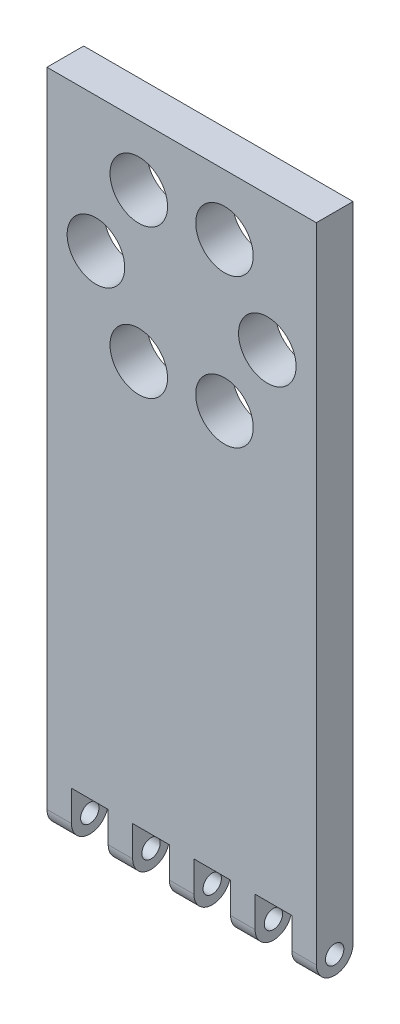
ISO-10303-21;
HEADER;
FILE_DESCRIPTION(('STEP AP214'),'2;1');
FILE_NAME('part.step','',(''),(''),'','','');
FILE_SCHEMA(('AUTOMOTIVE_DESIGN { 1 0 10303 214 1 1 1 1 }'));
ENDSEC;
DATA;
#1=APPLICATION_CONTEXT('core data for automotive mechanical design processes');
#2=APPLICATION_PROTOCOL_DEFINITION('international standard','automotive_design',2000,#1);
#3=PRODUCT_CONTEXT('',#1,'mechanical');
#4=PRODUCT('Part','Part','',(#3));
#5=PRODUCT_RELATED_PRODUCT_CATEGORY('part','',(#4));
#6=PRODUCT_DEFINITION_FORMATION('','',#4);
#7=PRODUCT_DEFINITION_CONTEXT('part definition',#1,'design');
#8=PRODUCT_DEFINITION('design','',#6,#7);
#9=PRODUCT_DEFINITION_SHAPE('','',#8);
#10=(LENGTH_UNIT() NAMED_UNIT(*) SI_UNIT(.MILLI.,.METRE.));
#11=(NAMED_UNIT(*) PLANE_ANGLE_UNIT() SI_UNIT($,.RADIAN.));
#12=(NAMED_UNIT(*) SI_UNIT($,.STERADIAN.) SOLID_ANGLE_UNIT());
#13=UNCERTAINTY_MEASURE_WITH_UNIT(LENGTH_MEASURE(1.E-05),#10,'distance_accuracy_value','');
#14=(GEOMETRIC_REPRESENTATION_CONTEXT(3) GLOBAL_UNCERTAINTY_ASSIGNED_CONTEXT((#13)) GLOBAL_UNIT_ASSIGNED_CONTEXT((#10,
#11,#12)) REPRESENTATION_CONTEXT('',''));
#15=CARTESIAN_POINT('',(0.,0.,0.));
#16=DIRECTION('',(0.,0.,1.));
#17=DIRECTION('',(1.,0.,0.));
#18=AXIS2_PLACEMENT_3D('',#15,#16,#17);
#19=CARTESIAN_POINT('',(-22.,-50.,6.));
#20=DIRECTION('',(0.,1.,0.));
#21=DIRECTION('',(0.,0.,1.));
#22=AXIS2_PLACEMENT_3D('',#19,#20,#21);
#23=PLANE('',#22);
#24=DIRECTION('',(0.,0.,-1.));
#25=VECTOR('',#24,1.);
#26=CARTESIAN_POINT('',(18.,-50.,6.));
#27=LINE('',#26,#25);
#28=CARTESIAN_POINT('',(18.,-50.,6.));
#29=VERTEX_POINT('',#28);
#30=CARTESIAN_POINT('',(18.,-50.,0.));
#31=VERTEX_POINT('',#30);
#32=EDGE_CURVE('E368',#29,#31,#27,.T.);
#33=ORIENTED_EDGE('',*,*,#32,.F.);
#34=DIRECTION('',(1.,0.,0.));
#35=VECTOR('',#34,1.);
#36=CARTESIAN_POINT('',(-22.,-50.,6.));
#37=LINE('',#36,#35);
#38=CARTESIAN_POINT('',(12.,-50.,6.));
#39=VERTEX_POINT('',#38);
#40=EDGE_CURVE('E228',#39,#29,#37,.T.);
#41=ORIENTED_EDGE('',*,*,#40,.F.);
#42=DIRECTION('',(0.,0.,1.));
#43=VECTOR('',#42,1.);
#44=CARTESIAN_POINT('',(12.,-50.,6.));
#45=LINE('',#44,#43);
#46=CARTESIAN_POINT('',(12.,-50.,0.));
#47=VERTEX_POINT('',#46);
#48=EDGE_CURVE('E206',#47,#39,#45,.T.);
#49=ORIENTED_EDGE('',*,*,#48,.F.);
#50=DIRECTION('',(1.,0.,0.));
#51=VECTOR('',#50,1.);
#52=CARTESIAN_POINT('',(-22.,-50.,0.));
#53=LINE('',#52,#51);
#54=EDGE_CURVE('E215',#47,#31,#53,.T.);
#55=ORIENTED_EDGE('',*,*,#54,.T.);
#56=EDGE_LOOP('',(#33,#41,#49,#55));
#57=FACE_BOUND('',#56,.T.);
#58=ADVANCED_FACE('F36',(#57),#23,.F.);
#59=DIRECTION('',(0.,0.,-1.));
#60=VECTOR('',#59,1.);
#61=CARTESIAN_POINT('',(8.00000000000001,-50.,6.));
#62=LINE('',#61,#60);
#63=CARTESIAN_POINT('',(8.00000000000001,-50.,6.));
#64=VERTEX_POINT('',#63);
#65=CARTESIAN_POINT('',(8.00000000000001,-50.,0.));
#66=VERTEX_POINT('',#65);
#67=EDGE_CURVE('E230',#64,#66,#62,.T.);
#68=ORIENTED_EDGE('',*,*,#67,.F.);
#69=CARTESIAN_POINT('',(2.00000000000001,-50.,6.));
#70=VERTEX_POINT('',#69);
#71=EDGE_CURVE('E431',#70,#64,#37,.T.);
#72=ORIENTED_EDGE('',*,*,#71,.F.);
#73=DIRECTION('',(0.,0.,1.));
#74=VECTOR('',#73,1.);
#75=CARTESIAN_POINT('',(2.00000000000001,-50.,6.));
#76=LINE('',#75,#74);
#77=CARTESIAN_POINT('',(2.00000000000001,-50.,0.));
#78=VERTEX_POINT('',#77);
#79=EDGE_CURVE('E242',#78,#70,#76,.T.);
#80=ORIENTED_EDGE('',*,*,#79,.F.);
#81=EDGE_CURVE('E222',#78,#66,#53,.T.);
#82=ORIENTED_EDGE('',*,*,#81,.T.);
#83=EDGE_LOOP('',(#68,#72,#80,#82));
#84=FACE_BOUND('',#83,.T.);
#85=ADVANCED_FACE('F457',(#84),#23,.F.);
#86=DIRECTION('',(0.,0.,-1.));
#87=VECTOR('',#86,1.);
#88=CARTESIAN_POINT('',(-1.99999999999999,-50.,6.));
#89=LINE('',#88,#87);
#90=CARTESIAN_POINT('',(-1.99999999999999,-50.,6.));
#91=VERTEX_POINT('',#90);
#92=CARTESIAN_POINT('',(-1.99999999999999,-50.,0.));
#93=VERTEX_POINT('',#92);
#94=EDGE_CURVE('E239',#91,#93,#89,.T.);
#95=ORIENTED_EDGE('',*,*,#94,.F.);
#96=CARTESIAN_POINT('',(-7.99999999999999,-50.,6.));
#97=VERTEX_POINT('',#96);
#98=EDGE_CURVE('E305',#97,#91,#37,.T.);
#99=ORIENTED_EDGE('',*,*,#98,.F.);
#100=DIRECTION('',(0.,0.,1.));
#101=VECTOR('',#100,1.);
#102=CARTESIAN_POINT('',(-7.99999999999999,-50.,6.));
#103=LINE('',#102,#101);
#104=CARTESIAN_POINT('',(-7.99999999999999,-50.,0.));
#105=VERTEX_POINT('',#104);
#106=EDGE_CURVE('E256',#105,#97,#103,.T.);
#107=ORIENTED_EDGE('',*,*,#106,.F.);
#108=EDGE_CURVE('E314',#105,#93,#53,.T.);
#109=ORIENTED_EDGE('',*,*,#108,.T.);
#110=EDGE_LOOP('',(#95,#99,#107,#109));
#111=FACE_BOUND('',#110,.T.);
#112=ADVANCED_FACE('F443',(#111),#23,.F.);
#113=DIRECTION('',(0.,0.,-1.));
#114=VECTOR('',#113,1.);
#115=CARTESIAN_POINT('',(-12.,-50.,6.));
#116=LINE('',#115,#114);
#117=CARTESIAN_POINT('',(-12.,-50.,6.));
#118=VERTEX_POINT('',#117);
#119=CARTESIAN_POINT('',(-12.,-50.,0.));
#120=VERTEX_POINT('',#119);
#121=EDGE_CURVE('E253',#118,#120,#116,.T.);
#122=ORIENTED_EDGE('',*,*,#121,.F.);
#123=CARTESIAN_POINT('',(-18.,-50.,6.));
#124=VERTEX_POINT('',#123);
#125=EDGE_CURVE('E301',#124,#118,#37,.T.);
#126=ORIENTED_EDGE('',*,*,#125,.F.);
#127=DIRECTION('',(0.,0.,1.));
#128=VECTOR('',#127,1.);
#129=CARTESIAN_POINT('',(-18.,-50.,6.));
#130=LINE('',#129,#128);
#131=CARTESIAN_POINT('',(-18.,-50.,0.));
#132=VERTEX_POINT('',#131);
#133=EDGE_CURVE('E268',#132,#124,#130,.T.);
#134=ORIENTED_EDGE('',*,*,#133,.F.);
#135=EDGE_CURVE('E225',#132,#120,#53,.T.);
#136=ORIENTED_EDGE('',*,*,#135,.T.);
#137=EDGE_LOOP('',(#122,#126,#134,#136));
#138=FACE_BOUND('',#137,.T.);
#139=ADVANCED_FACE('F483',(#138),#23,.F.);
#140=CARTESIAN_POINT('',(22.,50.,6.));
#141=DIRECTION('',(-1.,0.,0.));
#142=DIRECTION('',(0.,-1.,0.));
#143=AXIS2_PLACEMENT_3D('',#140,#141,#142);
#144=PLANE('',#143);
#145=CARTESIAN_POINT('',(22.,-55.,3.));
#146=DIRECTION('',(-1.,0.,0.));
#147=DIRECTION('',(0.,-1.,0.));
#148=AXIS2_PLACEMENT_3D('',#145,#146,#147);
#149=CIRCLE('',#148,1.5);
#150=CARTESIAN_POINT('',(22.,-56.5,3.));
#151=VERTEX_POINT('',#150);
#152=EDGE_CURVE('E856',#151,#151,#149,.T.);
#153=ORIENTED_EDGE('',*,*,#152,.T.);
#154=EDGE_LOOP('',(#153));
#155=FACE_BOUND('',#154,.T.);
#156=DIRECTION('',(0.,1.,0.));
#157=VECTOR('',#156,1.);
#158=CARTESIAN_POINT('',(22.,50.,6.));
#159=LINE('',#158,#157);
#160=CARTESIAN_POINT('',(22.,-55.,6.));
#161=VERTEX_POINT('',#160);
#162=CARTESIAN_POINT('',(22.,50.,6.));
#163=VERTEX_POINT('',#162);
#164=EDGE_CURVE('E294',#161,#163,#159,.T.);
#165=ORIENTED_EDGE('',*,*,#164,.F.);
#166=CARTESIAN_POINT('',(22.,-55.,3.));
#167=DIRECTION('',(-1.,0.,0.));
#168=DIRECTION('',(0.,-1.,0.));
#169=AXIS2_PLACEMENT_3D('',#166,#167,#168);
#170=CIRCLE('',#169,3.);
#171=CARTESIAN_POINT('',(22.,-58.,3.));
#172=VERTEX_POINT('',#171);
#173=EDGE_CURVE('E45',#161,#172,#170,.F.);
#174=ORIENTED_EDGE('',*,*,#173,.T.);
#175=CARTESIAN_POINT('',(22.,-55.,3.));
#176=DIRECTION('',(-1.,0.,0.));
#177=DIRECTION('',(0.,-1.,0.));
#178=AXIS2_PLACEMENT_3D('',#175,#176,#177);
#179=CIRCLE('',#178,3.);
#180=CARTESIAN_POINT('',(22.,-55.,0.));
#181=VERTEX_POINT('',#180);
#182=EDGE_CURVE('E56',#172,#181,#179,.F.);
#183=ORIENTED_EDGE('',*,*,#182,.T.);
#184=DIRECTION('',(0.,1.,0.));
#185=VECTOR('',#184,1.);
#186=CARTESIAN_POINT('',(22.,50.,0.));
#187=LINE('',#186,#185);
#188=CARTESIAN_POINT('',(22.,50.,0.));
#189=VERTEX_POINT('',#188);
#190=EDGE_CURVE('E306',#181,#189,#187,.T.);
#191=ORIENTED_EDGE('',*,*,#190,.T.);
#192=DIRECTION('',(0.,0.,-1.));
#193=VECTOR('',#192,1.);
#194=CARTESIAN_POINT('',(22.,50.,6.));
#195=LINE('',#194,#193);
#196=EDGE_CURVE('E317',#163,#189,#195,.T.);
#197=ORIENTED_EDGE('',*,*,#196,.F.);
#198=EDGE_LOOP('',(#165,#174,#183,#191,#197));
#199=FACE_BOUND('',#198,.T.);
#200=ADVANCED_FACE('F490',(#155,#199),#144,.F.);
#201=CARTESIAN_POINT('',(-22.,50.,6.));
#202=DIRECTION('',(0.,-1.,0.));
#203=DIRECTION('',(0.,0.,-1.));
#204=AXIS2_PLACEMENT_3D('',#201,#202,#203);
#205=PLANE('',#204);
#206=DIRECTION('',(-1.,0.,0.));
#207=VECTOR('',#206,1.);
#208=CARTESIAN_POINT('',(-22.,50.,0.));
#209=LINE('',#208,#207);
#210=CARTESIAN_POINT('',(-22.,50.,0.));
#211=VERTEX_POINT('',#210);
#212=EDGE_CURVE('E308',#189,#211,#209,.T.);
#213=ORIENTED_EDGE('',*,*,#212,.T.);
#214=DIRECTION('',(0.,0.,-1.));
#215=VECTOR('',#214,1.);
#216=CARTESIAN_POINT('',(-22.,50.,6.));
#217=LINE('',#216,#215);
#218=CARTESIAN_POINT('',(-22.,50.,6.));
#219=VERTEX_POINT('',#218);
#220=EDGE_CURVE('E304',#219,#211,#217,.T.);
#221=ORIENTED_EDGE('',*,*,#220,.F.);
#222=DIRECTION('',(-1.,0.,0.));
#223=VECTOR('',#222,1.);
#224=CARTESIAN_POINT('',(-22.,50.,6.));
#225=LINE('',#224,#223);
#226=EDGE_CURVE('E296',#163,#219,#225,.T.);
#227=ORIENTED_EDGE('',*,*,#226,.F.);
#228=ORIENTED_EDGE('',*,*,#196,.T.);
#229=EDGE_LOOP('',(#213,#221,#227,#228));
#230=FACE_BOUND('',#229,.T.);
#231=ADVANCED_FACE('F496',(#230),#205,.F.);
#232=CARTESIAN_POINT('',(-22.,50.,6.));
#233=DIRECTION('',(1.,0.,0.));
#234=DIRECTION('',(0.,1.,0.));
#235=AXIS2_PLACEMENT_3D('',#232,#233,#234);
#236=PLANE('',#235);
#237=CARTESIAN_POINT('',(-22.,-55.,3.));
#238=DIRECTION('',(-1.,0.,0.));
#239=DIRECTION('',(0.,-1.,0.));
#240=AXIS2_PLACEMENT_3D('',#237,#238,#239);
#241=CIRCLE('',#240,1.5);
#242=CARTESIAN_POINT('',(-22.,-56.5,3.));
#243=VERTEX_POINT('',#242);
#244=EDGE_CURVE('E553',#243,#243,#241,.T.);
#245=ORIENTED_EDGE('',*,*,#244,.F.);
#246=EDGE_LOOP('',(#245));
#247=FACE_BOUND('',#246,.T.);
#248=CARTESIAN_POINT('',(-22.,-55.,3.));
#249=DIRECTION('',(1.,0.,0.));
#250=DIRECTION('',(0.,1.,0.));
#251=AXIS2_PLACEMENT_3D('',#248,#249,#250);
#252=CIRCLE('',#251,3.);
#253=CARTESIAN_POINT('',(-22.,-55.,0.));
#254=VERTEX_POINT('',#253);
#255=CARTESIAN_POINT('',(-22.,-58.,3.));
#256=VERTEX_POINT('',#255);
#257=EDGE_CURVE('E320',#254,#256,#252,.F.);
#258=ORIENTED_EDGE('',*,*,#257,.T.);
#259=CARTESIAN_POINT('',(-22.,-55.,3.));
#260=DIRECTION('',(1.,0.,0.));
#261=DIRECTION('',(0.,1.,0.));
#262=AXIS2_PLACEMENT_3D('',#259,#260,#261);
#263=CIRCLE('',#262,3.);
#264=CARTESIAN_POINT('',(-22.,-55.,6.));
#265=VERTEX_POINT('',#264);
#266=EDGE_CURVE('E338',#256,#265,#263,.F.);
#267=ORIENTED_EDGE('',*,*,#266,.T.);
#268=DIRECTION('',(0.,-1.,0.));
#269=VECTOR('',#268,1.);
#270=CARTESIAN_POINT('',(-22.,50.,6.));
#271=LINE('',#270,#269);
#272=EDGE_CURVE('E298',#219,#265,#271,.T.);
#273=ORIENTED_EDGE('',*,*,#272,.F.);
#274=ORIENTED_EDGE('',*,*,#220,.T.);
#275=DIRECTION('',(0.,-1.,0.));
#276=VECTOR('',#275,1.);
#277=CARTESIAN_POINT('',(-22.,50.,0.));
#278=LINE('',#277,#276);
#279=EDGE_CURVE('E223',#211,#254,#278,.T.);
#280=ORIENTED_EDGE('',*,*,#279,.T.);
#281=EDGE_LOOP('',(#258,#267,#273,#274,#280));
#282=FACE_BOUND('',#281,.T.);
#283=ADVANCED_FACE('F541',(#247,#282),#236,.F.);
#284=CARTESIAN_POINT('',(0.,0.,6.));
#285=DIRECTION('',(0.,0.,1.));
#286=DIRECTION('',(1.,0.,0.));
#287=AXIS2_PLACEMENT_3D('',#284,#285,#286);
#288=PLANE('',#287);
#289=CARTESIAN_POINT('',(6.99738773492274,40.1233586192213,6.));
#290=DIRECTION('',(0.,0.,1.));
#291=DIRECTION('',(1.,0.,0.));
#292=AXIS2_PLACEMENT_3D('',#289,#290,#291);
#293=CIRCLE('',#292,4.70000000016671);
#294=CARTESIAN_POINT('',(11.6973877350894,40.1233586192213,6.));
#295=VERTEX_POINT('',#294);
#296=EDGE_CURVE('E279',#295,#295,#293,.T.);
#297=ORIENTED_EDGE('',*,*,#296,.F.);
#298=EDGE_LOOP('',(#297));
#299=FACE_BOUND('',#298,.T.);
#300=CARTESIAN_POINT('',(13.9973877349177,27.9990029662183,6.));
#301=DIRECTION('',(0.,0.,1.));
#302=DIRECTION('',(1.,0.,0.));
#303=AXIS2_PLACEMENT_3D('',#300,#301,#302);
#304=CIRCLE('',#303,4.7000000001696);
#305=CARTESIAN_POINT('',(18.6973877350873,27.9990029662183,6.));
#306=VERTEX_POINT('',#305);
#307=EDGE_CURVE('E283',#306,#306,#304,.T.);
#308=ORIENTED_EDGE('',*,*,#307,.F.);
#309=EDGE_LOOP('',(#308));
#310=FACE_BOUND('',#309,.T.);
#311=CARTESIAN_POINT('',(6.99738773491265,15.8746473132213,6.));
#312=DIRECTION('',(0.,0.,1.));
#313=DIRECTION('',(1.,0.,0.));
#314=AXIS2_PLACEMENT_3D('',#311,#312,#313);
#315=CIRCLE('',#314,4.70000000016031);
#316=CARTESIAN_POINT('',(11.697387735073,15.8746473132213,6.));
#317=VERTEX_POINT('',#316);
#318=EDGE_CURVE('E286',#317,#317,#315,.T.);
#319=ORIENTED_EDGE('',*,*,#318,.F.);
#320=EDGE_LOOP('',(#319));
#321=FACE_BOUND('',#320,.T.);
#322=CARTESIAN_POINT('',(-7.00261226490023,15.8746473132124,6.));
#323=DIRECTION('',(0.,0.,1.));
#324=DIRECTION('',(1.,0.,0.));
#325=AXIS2_PLACEMENT_3D('',#322,#323,#324);
#326=CIRCLE('',#325,4.7);
#327=CARTESIAN_POINT('',(-2.30261226490022,15.8746473132124,6.));
#328=VERTEX_POINT('',#327);
#329=EDGE_CURVE('E278',#328,#328,#326,.T.);
#330=ORIENTED_EDGE('',*,*,#329,.F.);
#331=EDGE_LOOP('',(#330));
#332=FACE_BOUND('',#331,.T.);
#333=CARTESIAN_POINT('',(-14.0026122650823,27.9990029662298,6.));
#334=DIRECTION('',(0.,0.,1.));
#335=DIRECTION('',(1.,0.,0.));
#336=AXIS2_PLACEMENT_3D('',#333,#334,#335);
#337=CIRCLE('',#336,4.70000000016303);
#338=CARTESIAN_POINT('',(-9.30261226491927,27.9990029662298,6.));
#339=VERTEX_POINT('',#338);
#340=EDGE_CURVE('E275',#339,#339,#337,.T.);
#341=ORIENTED_EDGE('',*,*,#340,.F.);
#342=EDGE_LOOP('',(#341));
#343=FACE_BOUND('',#342,.T.);
#344=CARTESIAN_POINT('',(-7.00261226489014,40.1233586192124,6.));
#345=DIRECTION('',(0.,0.,1.));
#346=DIRECTION('',(1.,0.,0.));
#347=AXIS2_PLACEMENT_3D('',#344,#345,#346);
#348=CIRCLE('',#347,4.7);
#349=CARTESIAN_POINT('',(-2.30261226489014,40.1233586192124,6.));
#350=VERTEX_POINT('',#349);
#351=EDGE_CURVE('E282',#350,#350,#348,.T.);
#352=ORIENTED_EDGE('',*,*,#351,.F.);
#353=EDGE_LOOP('',(#352));
#354=FACE_BOUND('',#353,.T.);
#355=DIRECTION('',(0.,1.,0.));
#356=VECTOR('',#355,1.);
#357=CARTESIAN_POINT('',(18.,-58.,6.));
#358=LINE('',#357,#356);
#359=CARTESIAN_POINT('',(18.,-55.,6.));
#360=VERTEX_POINT('',#359);
#361=EDGE_CURVE('E424',#360,#29,#358,.T.);
#362=ORIENTED_EDGE('',*,*,#361,.F.);
#363=DIRECTION('',(-1.,0.,0.));
#364=VECTOR('',#363,1.);
#365=CARTESIAN_POINT('',(0.,-55.,6.));
#366=LINE('',#365,#364);
#367=EDGE_CURVE('E404',#360,#161,#366,.F.);
#368=ORIENTED_EDGE('',*,*,#367,.T.);
#369=ORIENTED_EDGE('',*,*,#164,.T.);
#370=ORIENTED_EDGE('',*,*,#226,.T.);
#371=ORIENTED_EDGE('',*,*,#272,.T.);
#372=DIRECTION('',(-1.,0.,0.));
#373=VECTOR('',#372,1.);
#374=CARTESIAN_POINT('',(0.,-55.,6.));
#375=LINE('',#374,#373);
#376=CARTESIAN_POINT('',(-18.,-55.,6.));
#377=VERTEX_POINT('',#376);
#378=EDGE_CURVE('E340',#265,#377,#375,.F.);
#379=ORIENTED_EDGE('',*,*,#378,.T.);
#380=DIRECTION('',(0.,1.,0.));
#381=VECTOR('',#380,1.);
#382=CARTESIAN_POINT('',(-18.,-58.,6.));
#383=LINE('',#382,#381);
#384=EDGE_CURVE('E271',#377,#124,#383,.T.);
#385=ORIENTED_EDGE('',*,*,#384,.T.);
#386=ORIENTED_EDGE('',*,*,#125,.T.);
#387=DIRECTION('',(0.,1.,0.));
#388=VECTOR('',#387,1.);
#389=CARTESIAN_POINT('',(-12.,-58.,6.));
#390=LINE('',#389,#388);
#391=CARTESIAN_POINT('',(-12.,-55.,6.));
#392=VERTEX_POINT('',#391);
#393=EDGE_CURVE('E259',#392,#118,#390,.T.);
#394=ORIENTED_EDGE('',*,*,#393,.F.);
#395=DIRECTION('',(-1.,0.,0.));
#396=VECTOR('',#395,1.);
#397=CARTESIAN_POINT('',(0.,-55.,6.));
#398=LINE('',#397,#396);
#399=CARTESIAN_POINT('',(-7.99999999999999,-55.,6.));
#400=VERTEX_POINT('',#399);
#401=EDGE_CURVE('E355',#392,#400,#398,.F.);
#402=ORIENTED_EDGE('',*,*,#401,.T.);
#403=DIRECTION('',(0.,1.,0.));
#404=VECTOR('',#403,1.);
#405=CARTESIAN_POINT('',(-7.99999999999999,-58.,6.));
#406=LINE('',#405,#404);
#407=EDGE_CURVE('E261',#400,#97,#406,.T.);
#408=ORIENTED_EDGE('',*,*,#407,.T.);
#409=ORIENTED_EDGE('',*,*,#98,.T.);
#410=DIRECTION('',(0.,1.,0.));
#411=VECTOR('',#410,1.);
#412=CARTESIAN_POINT('',(-1.99999999999999,-58.,6.));
#413=LINE('',#412,#411);
#414=CARTESIAN_POINT('',(-1.99999999999999,-55.,6.));
#415=VERTEX_POINT('',#414);
#416=EDGE_CURVE('E245',#415,#91,#413,.T.);
#417=ORIENTED_EDGE('',*,*,#416,.F.);
#418=DIRECTION('',(-1.,0.,0.));
#419=VECTOR('',#418,1.);
#420=CARTESIAN_POINT('',(0.,-55.,6.));
#421=LINE('',#420,#419);
#422=CARTESIAN_POINT('',(2.00000000000001,-55.,6.));
#423=VERTEX_POINT('',#422);
#424=EDGE_CURVE('E373',#415,#423,#421,.F.);
#425=ORIENTED_EDGE('',*,*,#424,.T.);
#426=DIRECTION('',(0.,1.,0.));
#427=VECTOR('',#426,1.);
#428=CARTESIAN_POINT('',(2.00000000000001,-58.,6.));
#429=LINE('',#428,#427);
#430=EDGE_CURVE('E247',#423,#70,#429,.T.);
#431=ORIENTED_EDGE('',*,*,#430,.T.);
#432=ORIENTED_EDGE('',*,*,#71,.T.);
#433=DIRECTION('',(0.,1.,0.));
#434=VECTOR('',#433,1.);
#435=CARTESIAN_POINT('',(8.00000000000001,-58.,6.));
#436=LINE('',#435,#434);
#437=CARTESIAN_POINT('',(8.00000000000001,-55.,6.));
#438=VERTEX_POINT('',#437);
#439=EDGE_CURVE('E229',#438,#64,#436,.T.);
#440=ORIENTED_EDGE('',*,*,#439,.F.);
#441=DIRECTION('',(-1.,0.,0.));
#442=VECTOR('',#441,1.);
#443=CARTESIAN_POINT('',(0.,-55.,6.));
#444=LINE('',#443,#442);
#445=CARTESIAN_POINT('',(12.,-55.,6.));
#446=VERTEX_POINT('',#445);
#447=EDGE_CURVE('E389',#438,#446,#444,.F.);
#448=ORIENTED_EDGE('',*,*,#447,.T.);
#449=DIRECTION('',(0.,1.,0.));
#450=VECTOR('',#449,1.);
#451=CARTESIAN_POINT('',(12.,-58.,6.));
#452=LINE('',#451,#450);
#453=EDGE_CURVE('E212',#446,#39,#452,.T.);
#454=ORIENTED_EDGE('',*,*,#453,.T.);
#455=ORIENTED_EDGE('',*,*,#40,.T.);
#456=EDGE_LOOP('',(#362,#368,#369,#370,#371,#379,#385,#386,#394,#402,#408,#409,#417,#425,#431,
#432,#440,#448,#454,#455));
#457=FACE_BOUND('',#456,.T.);
#458=ADVANCED_FACE('F430',(#299,#310,#321,#332,#343,#354,#457),#288,.T.);
#459=CARTESIAN_POINT('',(0.,0.,0.));
#460=DIRECTION('',(0.,0.,1.));
#461=DIRECTION('',(1.,0.,0.));
#462=AXIS2_PLACEMENT_3D('',#459,#460,#461);
#463=PLANE('',#462);
#464=CARTESIAN_POINT('',(6.99738773492274,40.1233586192213,0.));
#465=DIRECTION('',(0.,0.,1.));
#466=DIRECTION('',(1.,0.,0.));
#467=AXIS2_PLACEMENT_3D('',#464,#465,#466);
#468=CIRCLE('',#467,4.70000000016671);
#469=CARTESIAN_POINT('',(11.6973877350894,40.1233586192213,0.));
#470=VERTEX_POINT('',#469);
#471=EDGE_CURVE('E309',#470,#470,#468,.T.);
#472=ORIENTED_EDGE('',*,*,#471,.T.);
#473=EDGE_LOOP('',(#472));
#474=FACE_BOUND('',#473,.T.);
#475=CARTESIAN_POINT('',(13.9973877349177,27.9990029662183,0.));
#476=DIRECTION('',(0.,0.,1.));
#477=DIRECTION('',(1.,0.,0.));
#478=AXIS2_PLACEMENT_3D('',#475,#476,#477);
#479=CIRCLE('',#478,4.7000000001696);
#480=CARTESIAN_POINT('',(18.6973877350873,27.9990029662183,0.));
#481=VERTEX_POINT('',#480);
#482=EDGE_CURVE('E332',#481,#481,#479,.T.);
#483=ORIENTED_EDGE('',*,*,#482,.T.);
#484=EDGE_LOOP('',(#483));
#485=FACE_BOUND('',#484,.T.);
#486=CARTESIAN_POINT('',(6.99738773491265,15.8746473132213,0.));
#487=DIRECTION('',(0.,0.,1.));
#488=DIRECTION('',(1.,0.,0.));
#489=AXIS2_PLACEMENT_3D('',#486,#487,#488);
#490=CIRCLE('',#489,4.70000000016031);
#491=CARTESIAN_POINT('',(11.697387735073,15.8746473132213,0.));
#492=VERTEX_POINT('',#491);
#493=EDGE_CURVE('E329',#492,#492,#490,.T.);
#494=ORIENTED_EDGE('',*,*,#493,.T.);
#495=EDGE_LOOP('',(#494));
#496=FACE_BOUND('',#495,.T.);
#497=CARTESIAN_POINT('',(-7.00261226490023,15.8746473132124,0.));
#498=DIRECTION('',(0.,0.,1.));
#499=DIRECTION('',(1.,0.,0.));
#500=AXIS2_PLACEMENT_3D('',#497,#498,#499);
#501=CIRCLE('',#500,4.7);
#502=CARTESIAN_POINT('',(-2.30261226490022,15.8746473132124,0.));
#503=VERTEX_POINT('',#502);
#504=EDGE_CURVE('E326',#503,#503,#501,.T.);
#505=ORIENTED_EDGE('',*,*,#504,.T.);
#506=EDGE_LOOP('',(#505));
#507=FACE_BOUND('',#506,.T.);
#508=CARTESIAN_POINT('',(-14.0026122650823,27.9990029662298,0.));
#509=DIRECTION('',(0.,0.,1.));
#510=DIRECTION('',(1.,0.,0.));
#511=AXIS2_PLACEMENT_3D('',#508,#509,#510);
#512=CIRCLE('',#511,4.70000000016303);
#513=CARTESIAN_POINT('',(-9.30261226491927,27.9990029662298,0.));
#514=VERTEX_POINT('',#513);
#515=EDGE_CURVE('E323',#514,#514,#512,.T.);
#516=ORIENTED_EDGE('',*,*,#515,.T.);
#517=EDGE_LOOP('',(#516));
#518=FACE_BOUND('',#517,.T.);
#519=CARTESIAN_POINT('',(-7.00261226489014,40.1233586192124,0.));
#520=DIRECTION('',(0.,0.,1.));
#521=DIRECTION('',(1.,0.,0.));
#522=AXIS2_PLACEMENT_3D('',#519,#520,#521);
#523=CIRCLE('',#522,4.7);
#524=CARTESIAN_POINT('',(-2.30261226489014,40.1233586192124,0.));
#525=VERTEX_POINT('',#524);
#526=EDGE_CURVE('E293',#525,#525,#523,.T.);
#527=ORIENTED_EDGE('',*,*,#526,.T.);
#528=EDGE_LOOP('',(#527));
#529=FACE_BOUND('',#528,.T.);
#530=ORIENTED_EDGE('',*,*,#190,.F.);
#531=DIRECTION('',(1.,0.,0.));
#532=VECTOR('',#531,1.);
#533=CARTESIAN_POINT('',(18.,-55.,0.));
#534=LINE('',#533,#532);
#535=CARTESIAN_POINT('',(18.,-55.,0.));
#536=VERTEX_POINT('',#535);
#537=EDGE_CURVE('E11',#181,#536,#534,.F.);
#538=ORIENTED_EDGE('',*,*,#537,.T.);
#539=DIRECTION('',(0.,1.,0.));
#540=VECTOR('',#539,1.);
#541=CARTESIAN_POINT('',(18.,-58.,0.));
#542=LINE('',#541,#540);
#543=EDGE_CURVE('E218',#536,#31,#542,.T.);
#544=ORIENTED_EDGE('',*,*,#543,.T.);
#545=ORIENTED_EDGE('',*,*,#54,.F.);
#546=DIRECTION('',(0.,1.,0.));
#547=VECTOR('',#546,1.);
#548=CARTESIAN_POINT('',(12.,-58.,0.));
#549=LINE('',#548,#547);
#550=CARTESIAN_POINT('',(12.,-55.,0.));
#551=VERTEX_POINT('',#550);
#552=EDGE_CURVE('E201',#551,#47,#549,.T.);
#553=ORIENTED_EDGE('',*,*,#552,.F.);
#554=DIRECTION('',(1.,0.,0.));
#555=VECTOR('',#554,1.);
#556=CARTESIAN_POINT('',(8.00000000000001,-55.,0.));
#557=LINE('',#556,#555);
#558=CARTESIAN_POINT('',(8.00000000000001,-55.,0.));
#559=VERTEX_POINT('',#558);
#560=EDGE_CURVE('E395',#551,#559,#557,.F.);
#561=ORIENTED_EDGE('',*,*,#560,.T.);
#562=DIRECTION('',(0.,1.,0.));
#563=VECTOR('',#562,1.);
#564=CARTESIAN_POINT('',(8.00000000000001,-58.,0.));
#565=LINE('',#564,#563);
#566=EDGE_CURVE('E211',#559,#66,#565,.T.);
#567=ORIENTED_EDGE('',*,*,#566,.T.);
#568=ORIENTED_EDGE('',*,*,#81,.F.);
#569=DIRECTION('',(0.,1.,0.));
#570=VECTOR('',#569,1.);
#571=CARTESIAN_POINT('',(2.00000000000001,-58.,0.));
#572=LINE('',#571,#570);
#573=CARTESIAN_POINT('',(2.00000000000001,-55.,0.));
#574=VERTEX_POINT('',#573);
#575=EDGE_CURVE('E249',#574,#78,#572,.T.);
#576=ORIENTED_EDGE('',*,*,#575,.F.);
#577=DIRECTION('',(1.,0.,0.));
#578=VECTOR('',#577,1.);
#579=CARTESIAN_POINT('',(-1.99999999999999,-55.,0.));
#580=LINE('',#579,#578);
#581=CARTESIAN_POINT('',(-1.99999999999999,-55.,0.));
#582=VERTEX_POINT('',#581);
#583=EDGE_CURVE('E380',#574,#582,#580,.F.);
#584=ORIENTED_EDGE('',*,*,#583,.T.);
#585=DIRECTION('',(0.,1.,0.));
#586=VECTOR('',#585,1.);
#587=CARTESIAN_POINT('',(-1.99999999999999,-58.,0.));
#588=LINE('',#587,#586);
#589=EDGE_CURVE('E251',#582,#93,#588,.T.);
#590=ORIENTED_EDGE('',*,*,#589,.T.);
#591=ORIENTED_EDGE('',*,*,#108,.F.);
#592=DIRECTION('',(0.,1.,0.));
#593=VECTOR('',#592,1.);
#594=CARTESIAN_POINT('',(-7.99999999999999,-58.,0.));
#595=LINE('',#594,#593);
#596=CARTESIAN_POINT('',(-7.99999999999999,-55.,0.));
#597=VERTEX_POINT('',#596);
#598=EDGE_CURVE('E263',#597,#105,#595,.T.);
#599=ORIENTED_EDGE('',*,*,#598,.F.);
#600=DIRECTION('',(1.,0.,0.));
#601=VECTOR('',#600,1.);
#602=CARTESIAN_POINT('',(-12.,-55.,0.));
#603=LINE('',#602,#601);
#604=CARTESIAN_POINT('',(-12.,-55.,0.));
#605=VERTEX_POINT('',#604);
#606=EDGE_CURVE('E362',#597,#605,#603,.F.);
#607=ORIENTED_EDGE('',*,*,#606,.T.);
#608=DIRECTION('',(0.,1.,0.));
#609=VECTOR('',#608,1.);
#610=CARTESIAN_POINT('',(-12.,-58.,0.));
#611=LINE('',#610,#609);
#612=EDGE_CURVE('E265',#605,#120,#611,.T.);
#613=ORIENTED_EDGE('',*,*,#612,.T.);
#614=ORIENTED_EDGE('',*,*,#135,.F.);
#615=DIRECTION('',(0.,1.,0.));
#616=VECTOR('',#615,1.);
#617=CARTESIAN_POINT('',(-18.,-58.,0.));
#618=LINE('',#617,#616);
#619=CARTESIAN_POINT('',(-18.,-55.,0.));
#620=VERTEX_POINT('',#619);
#621=EDGE_CURVE('E273',#620,#132,#618,.T.);
#622=ORIENTED_EDGE('',*,*,#621,.F.);
#623=DIRECTION('',(1.,0.,0.));
#624=VECTOR('',#623,1.);
#625=CARTESIAN_POINT('',(-22.,-55.,0.));
#626=LINE('',#625,#624);
#627=EDGE_CURVE('E347',#620,#254,#626,.F.);
#628=ORIENTED_EDGE('',*,*,#627,.T.);
#629=ORIENTED_EDGE('',*,*,#279,.F.);
#630=ORIENTED_EDGE('',*,*,#212,.F.);
#631=EDGE_LOOP('',(#530,#538,#544,#545,#553,#561,#567,#568,#576,#584,#590,#591,#599,#607,#613,
#614,#622,#628,#629,#630));
#632=FACE_BOUND('',#631,.T.);
#633=ADVANCED_FACE('F216',(#474,#485,#496,#507,#518,#529,#632),#463,.F.);
#634=CARTESIAN_POINT('',(-7.00261226489014,40.1233586192124,-4.));
#635=DIRECTION('',(0.,0.,1.));
#636=DIRECTION('',(1.,0.,0.));
#637=AXIS2_PLACEMENT_3D('',#634,#635,#636);
#638=CYLINDRICAL_SURFACE('',#637,4.7);
#639=ORIENTED_EDGE('',*,*,#351,.T.);
#640=EDGE_LOOP('',(#639));
#641=FACE_BOUND('',#640,.T.);
#642=ORIENTED_EDGE('',*,*,#526,.F.);
#643=EDGE_LOOP('',(#642));
#644=FACE_BOUND('',#643,.T.);
#645=ADVANCED_FACE('F620',(#641,#644),#638,.F.);
#646=CARTESIAN_POINT('',(-14.0026122650823,27.9990029662298,-4.));
#647=DIRECTION('',(0.,0.,1.));
#648=DIRECTION('',(1.,0.,0.));
#649=AXIS2_PLACEMENT_3D('',#646,#647,#648);
#650=CYLINDRICAL_SURFACE('',#649,4.70000000016303);
#651=ORIENTED_EDGE('',*,*,#340,.T.);
#652=EDGE_LOOP('',(#651));
#653=FACE_BOUND('',#652,.T.);
#654=ORIENTED_EDGE('',*,*,#515,.F.);
#655=EDGE_LOOP('',(#654));
#656=FACE_BOUND('',#655,.T.);
#657=ADVANCED_FACE('F707',(#653,#656),#650,.F.);
#658=CARTESIAN_POINT('',(-7.00261226490023,15.8746473132124,-4.));
#659=DIRECTION('',(0.,0.,1.));
#660=DIRECTION('',(1.,0.,0.));
#661=AXIS2_PLACEMENT_3D('',#658,#659,#660);
#662=CYLINDRICAL_SURFACE('',#661,4.7);
#663=ORIENTED_EDGE('',*,*,#329,.T.);
#664=EDGE_LOOP('',(#663));
#665=FACE_BOUND('',#664,.T.);
#666=ORIENTED_EDGE('',*,*,#504,.F.);
#667=EDGE_LOOP('',(#666));
#668=FACE_BOUND('',#667,.T.);
#669=ADVANCED_FACE('F697',(#665,#668),#662,.F.);
#670=CARTESIAN_POINT('',(6.99738773491265,15.8746473132213,-4.));
#671=DIRECTION('',(0.,0.,1.));
#672=DIRECTION('',(1.,0.,0.));
#673=AXIS2_PLACEMENT_3D('',#670,#671,#672);
#674=CYLINDRICAL_SURFACE('',#673,4.70000000016031);
#675=ORIENTED_EDGE('',*,*,#318,.T.);
#676=EDGE_LOOP('',(#675));
#677=FACE_BOUND('',#676,.T.);
#678=ORIENTED_EDGE('',*,*,#493,.F.);
#679=EDGE_LOOP('',(#678));
#680=FACE_BOUND('',#679,.T.);
#681=ADVANCED_FACE('F687',(#677,#680),#674,.F.);
#682=CARTESIAN_POINT('',(13.9973877349177,27.9990029662183,-4.));
#683=DIRECTION('',(0.,0.,1.));
#684=DIRECTION('',(1.,0.,0.));
#685=AXIS2_PLACEMENT_3D('',#682,#683,#684);
#686=CYLINDRICAL_SURFACE('',#685,4.7000000001696);
#687=ORIENTED_EDGE('',*,*,#307,.T.);
#688=EDGE_LOOP('',(#687));
#689=FACE_BOUND('',#688,.T.);
#690=ORIENTED_EDGE('',*,*,#482,.F.);
#691=EDGE_LOOP('',(#690));
#692=FACE_BOUND('',#691,.T.);
#693=ADVANCED_FACE('F676',(#689,#692),#686,.F.);
#694=CARTESIAN_POINT('',(6.99738773492274,40.1233586192213,-4.));
#695=DIRECTION('',(0.,0.,1.));
#696=DIRECTION('',(1.,0.,0.));
#697=AXIS2_PLACEMENT_3D('',#694,#695,#696);
#698=CYLINDRICAL_SURFACE('',#697,4.70000000016671);
#699=ORIENTED_EDGE('',*,*,#296,.T.);
#700=EDGE_LOOP('',(#699));
#701=FACE_BOUND('',#700,.T.);
#702=ORIENTED_EDGE('',*,*,#471,.F.);
#703=EDGE_LOOP('',(#702));
#704=FACE_BOUND('',#703,.T.);
#705=ADVANCED_FACE('F671',(#701,#704),#698,.F.);
#706=CARTESIAN_POINT('',(-18.,-58.,6.));
#707=DIRECTION('',(-1.,0.,0.));
#708=DIRECTION('',(0.,0.,1.));
#709=AXIS2_PLACEMENT_3D('',#706,#707,#708);
#710=PLANE('',#709);
#711=CARTESIAN_POINT('',(-18.,-55.,3.));
#712=DIRECTION('',(-1.,0.,0.));
#713=DIRECTION('',(0.,0.,1.));
#714=AXIS2_PLACEMENT_3D('',#711,#712,#713);
#715=CIRCLE('',#714,1.5);
#716=CARTESIAN_POINT('',(-18.,-55.,4.5));
#717=VERTEX_POINT('',#716);
#718=EDGE_CURVE('E409',#717,#717,#715,.T.);
#719=ORIENTED_EDGE('',*,*,#718,.T.);
#720=EDGE_LOOP('',(#719));
#721=FACE_BOUND('',#720,.T.);
#722=ORIENTED_EDGE('',*,*,#384,.F.);
#723=CARTESIAN_POINT('',(-18.,-55.,3.));
#724=DIRECTION('',(-1.,0.,0.));
#725=DIRECTION('',(0.,0.,1.));
#726=AXIS2_PLACEMENT_3D('',#723,#724,#725);
#727=CIRCLE('',#726,3.);
#728=CARTESIAN_POINT('',(-18.,-58.,3.));
#729=VERTEX_POINT('',#728);
#730=EDGE_CURVE('E345',#377,#729,#727,.F.);
#731=ORIENTED_EDGE('',*,*,#730,.T.);
#732=CARTESIAN_POINT('',(-18.,-55.,3.));
#733=DIRECTION('',(-1.,0.,0.));
#734=DIRECTION('',(0.,0.,1.));
#735=AXIS2_PLACEMENT_3D('',#732,#733,#734);
#736=CIRCLE('',#735,3.);
#737=EDGE_CURVE('E343',#729,#620,#736,.F.);
#738=ORIENTED_EDGE('',*,*,#737,.T.);
#739=ORIENTED_EDGE('',*,*,#621,.T.);
#740=ORIENTED_EDGE('',*,*,#133,.T.);
#741=EDGE_LOOP('',(#722,#731,#738,#739,#740));
#742=FACE_BOUND('',#741,.T.);
#743=ADVANCED_FACE('F510',(#721,#742),#710,.F.);
#744=CARTESIAN_POINT('',(0.,-55.,3.));
#745=DIRECTION('',(-1.,0.,0.));
#746=DIRECTION('',(0.,0.,1.));
#747=AXIS2_PLACEMENT_3D('',#744,#745,#746);
#748=CYLINDRICAL_SURFACE('',#747,3.);
#749=ORIENTED_EDGE('',*,*,#627,.F.);
#750=ORIENTED_EDGE('',*,*,#737,.F.);
#751=DIRECTION('',(1.,0.,0.));
#752=VECTOR('',#751,1.);
#753=CARTESIAN_POINT('',(-18.,-58.,3.));
#754=LINE('',#753,#752);
#755=EDGE_CURVE('E267',#256,#729,#754,.T.);
#756=ORIENTED_EDGE('',*,*,#755,.F.);
#757=ORIENTED_EDGE('',*,*,#257,.F.);
#758=EDGE_LOOP('',(#749,#750,#756,#757));
#759=FACE_BOUND('',#758,.T.);
#760=ADVANCED_FACE('F532',(#759),#748,.T.);
#761=CARTESIAN_POINT('',(0.,-55.,3.));
#762=DIRECTION('',(-1.,0.,0.));
#763=DIRECTION('',(0.,0.,1.));
#764=AXIS2_PLACEMENT_3D('',#761,#762,#763);
#765=CYLINDRICAL_SURFACE('',#764,3.);
#766=ORIENTED_EDGE('',*,*,#730,.F.);
#767=ORIENTED_EDGE('',*,*,#378,.F.);
#768=ORIENTED_EDGE('',*,*,#266,.F.);
#769=ORIENTED_EDGE('',*,*,#755,.T.);
#770=EDGE_LOOP('',(#766,#767,#768,#769));
#771=FACE_BOUND('',#770,.T.);
#772=ADVANCED_FACE('F535',(#771),#765,.T.);
#773=CARTESIAN_POINT('',(-12.,-58.,6.));
#774=DIRECTION('',(1.,0.,0.));
#775=DIRECTION('',(0.,0.,-1.));
#776=AXIS2_PLACEMENT_3D('',#773,#774,#775);
#777=PLANE('',#776);
#778=CARTESIAN_POINT('',(-12.,-55.,3.));
#779=DIRECTION('',(1.,0.,0.));
#780=DIRECTION('',(0.,0.,-1.));
#781=AXIS2_PLACEMENT_3D('',#778,#779,#780);
#782=CIRCLE('',#781,1.5);
#783=CARTESIAN_POINT('',(-12.,-55.,1.5));
#784=VERTEX_POINT('',#783);
#785=EDGE_CURVE('E414',#784,#784,#782,.T.);
#786=ORIENTED_EDGE('',*,*,#785,.T.);
#787=EDGE_LOOP('',(#786));
#788=FACE_BOUND('',#787,.T.);
#789=CARTESIAN_POINT('',(-12.,-55.,3.));
#790=DIRECTION('',(1.,0.,0.));
#791=DIRECTION('',(0.,0.,-1.));
#792=AXIS2_PLACEMENT_3D('',#789,#790,#791);
#793=CIRCLE('',#792,3.);
#794=CARTESIAN_POINT('',(-12.,-58.,3.));
#795=VERTEX_POINT('',#794);
#796=EDGE_CURVE('E349',#605,#795,#793,.F.);
#797=ORIENTED_EDGE('',*,*,#796,.T.);
#798=CARTESIAN_POINT('',(-12.,-55.,3.));
#799=DIRECTION('',(1.,0.,0.));
#800=DIRECTION('',(0.,0.,-1.));
#801=AXIS2_PLACEMENT_3D('',#798,#799,#800);
#802=CIRCLE('',#801,3.);
#803=EDGE_CURVE('E353',#795,#392,#802,.F.);
#804=ORIENTED_EDGE('',*,*,#803,.T.);
#805=ORIENTED_EDGE('',*,*,#393,.T.);
#806=ORIENTED_EDGE('',*,*,#121,.T.);
#807=ORIENTED_EDGE('',*,*,#612,.F.);
#808=EDGE_LOOP('',(#797,#804,#805,#806,#807));
#809=FACE_BOUND('',#808,.T.);
#810=ADVANCED_FACE('F515',(#788,#809),#777,.F.);
#811=CARTESIAN_POINT('',(-7.99999999999999,-58.,6.));
#812=DIRECTION('',(-1.,0.,0.));
#813=DIRECTION('',(0.,0.,1.));
#814=AXIS2_PLACEMENT_3D('',#811,#812,#813);
#815=PLANE('',#814);
#816=CARTESIAN_POINT('',(-7.99999999999999,-55.,3.));
#817=DIRECTION('',(-1.,0.,0.));
#818=DIRECTION('',(0.,0.,1.));
#819=AXIS2_PLACEMENT_3D('',#816,#817,#818);
#820=CIRCLE('',#819,1.5);
#821=CARTESIAN_POINT('',(-7.99999999999999,-55.,4.5));
#822=VERTEX_POINT('',#821);
#823=EDGE_CURVE('E419',#822,#822,#820,.T.);
#824=ORIENTED_EDGE('',*,*,#823,.T.);
#825=EDGE_LOOP('',(#824));
#826=FACE_BOUND('',#825,.T.);
#827=ORIENTED_EDGE('',*,*,#407,.F.);
#828=CARTESIAN_POINT('',(-7.99999999999999,-55.,3.));
#829=DIRECTION('',(-1.,0.,0.));
#830=DIRECTION('',(0.,0.,1.));
#831=AXIS2_PLACEMENT_3D('',#828,#829,#830);
#832=CIRCLE('',#831,3.);
#833=CARTESIAN_POINT('',(-7.99999999999999,-58.,3.));
#834=VERTEX_POINT('',#833);
#835=EDGE_CURVE('E360',#400,#834,#832,.F.);
#836=ORIENTED_EDGE('',*,*,#835,.T.);
#837=CARTESIAN_POINT('',(-7.99999999999999,-55.,3.));
#838=DIRECTION('',(-1.,0.,0.));
#839=DIRECTION('',(0.,0.,1.));
#840=AXIS2_PLACEMENT_3D('',#837,#838,#839);
#841=CIRCLE('',#840,3.);
#842=EDGE_CURVE('E358',#834,#597,#841,.F.);
#843=ORIENTED_EDGE('',*,*,#842,.T.);
#844=ORIENTED_EDGE('',*,*,#598,.T.);
#845=ORIENTED_EDGE('',*,*,#106,.T.);
#846=EDGE_LOOP('',(#827,#836,#843,#844,#845));
#847=FACE_BOUND('',#846,.T.);
#848=ADVANCED_FACE('F446',(#826,#847),#815,.F.);
#849=CARTESIAN_POINT('',(-1.99999999999999,-58.,6.));
#850=DIRECTION('',(1.,0.,0.));
#851=DIRECTION('',(0.,0.,-1.));
#852=AXIS2_PLACEMENT_3D('',#849,#850,#851);
#853=PLANE('',#852);
#854=CARTESIAN_POINT('',(-1.99999999999999,-55.,3.));
#855=DIRECTION('',(1.,0.,0.));
#856=DIRECTION('',(0.,0.,-1.));
#857=AXIS2_PLACEMENT_3D('',#854,#855,#856);
#858=CIRCLE('',#857,1.5);
#859=CARTESIAN_POINT('',(-1.99999999999999,-55.,1.5));
#860=VERTEX_POINT('',#859);
#861=EDGE_CURVE('E870',#860,#860,#858,.T.);
#862=ORIENTED_EDGE('',*,*,#861,.T.);
#863=EDGE_LOOP('',(#862));
#864=FACE_BOUND('',#863,.T.);
#865=CARTESIAN_POINT('',(-1.99999999999999,-55.,3.));
#866=DIRECTION('',(1.,0.,0.));
#867=DIRECTION('',(0.,0.,-1.));
#868=AXIS2_PLACEMENT_3D('',#865,#866,#867);
#869=CIRCLE('',#868,3.);
#870=CARTESIAN_POINT('',(-1.99999999999999,-58.,3.));
#871=VERTEX_POINT('',#870);
#872=EDGE_CURVE('E364',#582,#871,#869,.F.);
#873=ORIENTED_EDGE('',*,*,#872,.T.);
#874=CARTESIAN_POINT('',(-1.99999999999999,-55.,3.));
#875=DIRECTION('',(1.,0.,0.));
#876=DIRECTION('',(0.,0.,-1.));
#877=AXIS2_PLACEMENT_3D('',#874,#875,#876);
#878=CIRCLE('',#877,3.);
#879=EDGE_CURVE('E371',#871,#415,#878,.F.);
#880=ORIENTED_EDGE('',*,*,#879,.T.);
#881=ORIENTED_EDGE('',*,*,#416,.T.);
#882=ORIENTED_EDGE('',*,*,#94,.T.);
#883=ORIENTED_EDGE('',*,*,#589,.F.);
#884=EDGE_LOOP('',(#873,#880,#881,#882,#883));
#885=FACE_BOUND('',#884,.T.);
#886=ADVANCED_FACE('F766',(#864,#885),#853,.F.);
#887=CARTESIAN_POINT('',(2.00000000000001,-58.,6.));
#888=DIRECTION('',(-1.,0.,0.));
#889=DIRECTION('',(0.,0.,1.));
#890=AXIS2_PLACEMENT_3D('',#887,#888,#889);
#891=PLANE('',#890);
#892=CARTESIAN_POINT('',(2.00000000000001,-55.,3.));
#893=DIRECTION('',(-1.,0.,0.));
#894=DIRECTION('',(0.,0.,1.));
#895=AXIS2_PLACEMENT_3D('',#892,#893,#894);
#896=CIRCLE('',#895,1.5);
#897=CARTESIAN_POINT('',(2.00000000000001,-55.,4.5));
#898=VERTEX_POINT('',#897);
#899=EDGE_CURVE('E867',#898,#898,#896,.T.);
#900=ORIENTED_EDGE('',*,*,#899,.T.);
#901=EDGE_LOOP('',(#900));
#902=FACE_BOUND('',#901,.T.);
#903=ORIENTED_EDGE('',*,*,#430,.F.);
#904=CARTESIAN_POINT('',(2.00000000000001,-55.,3.));
#905=DIRECTION('',(-1.,0.,0.));
#906=DIRECTION('',(0.,0.,1.));
#907=AXIS2_PLACEMENT_3D('',#904,#905,#906);
#908=CIRCLE('',#907,3.);
#909=CARTESIAN_POINT('',(2.00000000000001,-58.,3.));
#910=VERTEX_POINT('',#909);
#911=EDGE_CURVE('E378',#423,#910,#908,.F.);
#912=ORIENTED_EDGE('',*,*,#911,.T.);
#913=CARTESIAN_POINT('',(2.00000000000001,-55.,3.));
#914=DIRECTION('',(-1.,0.,0.));
#915=DIRECTION('',(0.,0.,1.));
#916=AXIS2_PLACEMENT_3D('',#913,#914,#915);
#917=CIRCLE('',#916,3.);
#918=EDGE_CURVE('E376',#910,#574,#917,.F.);
#919=ORIENTED_EDGE('',*,*,#918,.T.);
#920=ORIENTED_EDGE('',*,*,#575,.T.);
#921=ORIENTED_EDGE('',*,*,#79,.T.);
#922=EDGE_LOOP('',(#903,#912,#919,#920,#921));
#923=FACE_BOUND('',#922,.T.);
#924=ADVANCED_FACE('F776',(#902,#923),#891,.F.);
#925=CARTESIAN_POINT('',(8.00000000000001,-58.,6.));
#926=DIRECTION('',(1.,0.,0.));
#927=DIRECTION('',(0.,0.,-1.));
#928=AXIS2_PLACEMENT_3D('',#925,#926,#927);
#929=PLANE('',#928);
#930=CARTESIAN_POINT('',(8.00000000000001,-55.,3.));
#931=DIRECTION('',(1.,0.,0.));
#932=DIRECTION('',(0.,0.,-1.));
#933=AXIS2_PLACEMENT_3D('',#930,#931,#932);
#934=CIRCLE('',#933,1.5);
#935=CARTESIAN_POINT('',(8.00000000000001,-55.,1.5));
#936=VERTEX_POINT('',#935);
#937=EDGE_CURVE('E864',#936,#936,#934,.T.);
#938=ORIENTED_EDGE('',*,*,#937,.T.);
#939=EDGE_LOOP('',(#938));
#940=FACE_BOUND('',#939,.T.);
#941=CARTESIAN_POINT('',(8.00000000000001,-55.,3.));
#942=DIRECTION('',(1.,0.,0.));
#943=DIRECTION('',(0.,0.,-1.));
#944=AXIS2_PLACEMENT_3D('',#941,#942,#943);
#945=CIRCLE('',#944,3.);
#946=CARTESIAN_POINT('',(8.00000000000001,-58.,3.));
#947=VERTEX_POINT('',#946);
#948=EDGE_CURVE('E382',#559,#947,#945,.F.);
#949=ORIENTED_EDGE('',*,*,#948,.T.);
#950=CARTESIAN_POINT('',(8.00000000000001,-55.,3.));
#951=DIRECTION('',(1.,0.,0.));
#952=DIRECTION('',(0.,0.,-1.));
#953=AXIS2_PLACEMENT_3D('',#950,#951,#952);
#954=CIRCLE('',#953,3.);
#955=EDGE_CURVE('E387',#947,#438,#954,.F.);
#956=ORIENTED_EDGE('',*,*,#955,.T.);
#957=ORIENTED_EDGE('',*,*,#439,.T.);
#958=ORIENTED_EDGE('',*,*,#67,.T.);
#959=ORIENTED_EDGE('',*,*,#566,.F.);
#960=EDGE_LOOP('',(#949,#956,#957,#958,#959));
#961=FACE_BOUND('',#960,.T.);
#962=ADVANCED_FACE('F461',(#940,#961),#929,.F.);
#963=CARTESIAN_POINT('',(12.,-58.,6.));
#964=DIRECTION('',(-1.,0.,0.));
#965=DIRECTION('',(0.,0.,1.));
#966=AXIS2_PLACEMENT_3D('',#963,#964,#965);
#967=PLANE('',#966);
#968=CARTESIAN_POINT('',(12.,-55.,3.));
#969=DIRECTION('',(-1.,0.,0.));
#970=DIRECTION('',(0.,0.,1.));
#971=AXIS2_PLACEMENT_3D('',#968,#969,#970);
#972=CIRCLE('',#971,1.5);
#973=CARTESIAN_POINT('',(12.,-55.,4.5));
#974=VERTEX_POINT('',#973);
#975=EDGE_CURVE('E861',#974,#974,#972,.T.);
#976=ORIENTED_EDGE('',*,*,#975,.T.);
#977=EDGE_LOOP('',(#976));
#978=FACE_BOUND('',#977,.T.);
#979=ORIENTED_EDGE('',*,*,#453,.F.);
#980=CARTESIAN_POINT('',(12.,-55.,3.));
#981=DIRECTION('',(-1.,0.,0.));
#982=DIRECTION('',(0.,0.,1.));
#983=AXIS2_PLACEMENT_3D('',#980,#981,#982);
#984=CIRCLE('',#983,3.);
#985=CARTESIAN_POINT('',(12.,-58.,3.));
#986=VERTEX_POINT('',#985);
#987=EDGE_CURVE('E393',#446,#986,#984,.F.);
#988=ORIENTED_EDGE('',*,*,#987,.T.);
#989=CARTESIAN_POINT('',(12.,-55.,3.));
#990=DIRECTION('',(-1.,0.,0.));
#991=DIRECTION('',(0.,0.,1.));
#992=AXIS2_PLACEMENT_3D('',#989,#990,#991);
#993=CIRCLE('',#992,3.);
#994=EDGE_CURVE('E208',#986,#551,#993,.F.);
#995=ORIENTED_EDGE('',*,*,#994,.T.);
#996=ORIENTED_EDGE('',*,*,#552,.T.);
#997=ORIENTED_EDGE('',*,*,#48,.T.);
#998=EDGE_LOOP('',(#979,#988,#995,#996,#997));
#999=FACE_BOUND('',#998,.T.);
#1000=ADVANCED_FACE('F204',(#978,#999),#967,.F.);
#1001=CARTESIAN_POINT('',(18.,-58.,6.));
#1002=DIRECTION('',(1.,0.,0.));
#1003=DIRECTION('',(0.,0.,-1.));
#1004=AXIS2_PLACEMENT_3D('',#1001,#1002,#1003);
#1005=PLANE('',#1004);
#1006=CARTESIAN_POINT('',(18.,-55.,3.));
#1007=DIRECTION('',(1.,0.,0.));
#1008=DIRECTION('',(0.,0.,-1.));
#1009=AXIS2_PLACEMENT_3D('',#1006,#1007,#1008);
#1010=CIRCLE('',#1009,1.5);
#1011=CARTESIAN_POINT('',(18.,-55.,1.5));
#1012=VERTEX_POINT('',#1011);
#1013=EDGE_CURVE('E40',#1012,#1012,#1010,.T.);
#1014=ORIENTED_EDGE('',*,*,#1013,.T.);
#1015=EDGE_LOOP('',(#1014));
#1016=FACE_BOUND('',#1015,.T.);
#1017=CARTESIAN_POINT('',(18.,-55.,3.));
#1018=DIRECTION('',(1.,0.,0.));
#1019=DIRECTION('',(0.,0.,-1.));
#1020=AXIS2_PLACEMENT_3D('',#1017,#1018,#1019);
#1021=CIRCLE('',#1020,3.);
#1022=CARTESIAN_POINT('',(18.,-58.,3.));
#1023=VERTEX_POINT('',#1022);
#1024=EDGE_CURVE('E397',#536,#1023,#1021,.F.);
#1025=ORIENTED_EDGE('',*,*,#1024,.T.);
#1026=CARTESIAN_POINT('',(18.,-55.,3.));
#1027=DIRECTION('',(1.,0.,0.));
#1028=DIRECTION('',(0.,0.,-1.));
#1029=AXIS2_PLACEMENT_3D('',#1026,#1027,#1028);
#1030=CIRCLE('',#1029,3.);
#1031=EDGE_CURVE('E402',#1023,#360,#1030,.F.);
#1032=ORIENTED_EDGE('',*,*,#1031,.T.);
#1033=ORIENTED_EDGE('',*,*,#361,.T.);
#1034=ORIENTED_EDGE('',*,*,#32,.T.);
#1035=ORIENTED_EDGE('',*,*,#543,.F.);
#1036=EDGE_LOOP('',(#1025,#1032,#1033,#1034,#1035));
#1037=FACE_BOUND('',#1036,.T.);
#1038=ADVANCED_FACE('F427',(#1016,#1037),#1005,.F.);
#1039=CARTESIAN_POINT('',(10.,-55.,3.));
#1040=DIRECTION('',(-1.,0.,0.));
#1041=DIRECTION('',(0.,0.,1.));
#1042=AXIS2_PLACEMENT_3D('',#1039,#1040,#1041);
#1043=CYLINDRICAL_SURFACE('',#1042,3.);
#1044=ORIENTED_EDGE('',*,*,#606,.F.);
#1045=ORIENTED_EDGE('',*,*,#842,.F.);
#1046=DIRECTION('',(1.,0.,0.));
#1047=VECTOR('',#1046,1.);
#1048=CARTESIAN_POINT('',(-7.99999999999999,-58.,3.));
#1049=LINE('',#1048,#1047);
#1050=EDGE_CURVE('E365',#795,#834,#1049,.T.);
#1051=ORIENTED_EDGE('',*,*,#1050,.F.);
#1052=ORIENTED_EDGE('',*,*,#796,.F.);
#1053=EDGE_LOOP('',(#1044,#1045,#1051,#1052));
#1054=FACE_BOUND('',#1053,.T.);
#1055=ADVANCED_FACE('F518',(#1054),#1043,.T.);
#1056=CARTESIAN_POINT('',(10.,-55.,3.));
#1057=DIRECTION('',(-1.,0.,0.));
#1058=DIRECTION('',(0.,0.,1.));
#1059=AXIS2_PLACEMENT_3D('',#1056,#1057,#1058);
#1060=CYLINDRICAL_SURFACE('',#1059,3.);
#1061=ORIENTED_EDGE('',*,*,#835,.F.);
#1062=ORIENTED_EDGE('',*,*,#401,.F.);
#1063=ORIENTED_EDGE('',*,*,#803,.F.);
#1064=ORIENTED_EDGE('',*,*,#1050,.T.);
#1065=EDGE_LOOP('',(#1061,#1062,#1063,#1064));
#1066=FACE_BOUND('',#1065,.T.);
#1067=ADVANCED_FACE('F521',(#1066),#1060,.T.);
#1068=CARTESIAN_POINT('',(20.,-55.,3.));
#1069=DIRECTION('',(-1.,0.,0.));
#1070=DIRECTION('',(0.,0.,1.));
#1071=AXIS2_PLACEMENT_3D('',#1068,#1069,#1070);
#1072=CYLINDRICAL_SURFACE('',#1071,3.);
#1073=ORIENTED_EDGE('',*,*,#583,.F.);
#1074=ORIENTED_EDGE('',*,*,#918,.F.);
#1075=DIRECTION('',(1.,0.,0.));
#1076=VECTOR('',#1075,1.);
#1077=CARTESIAN_POINT('',(2.00000000000001,-58.,3.));
#1078=LINE('',#1077,#1076);
#1079=EDGE_CURVE('E369',#871,#910,#1078,.T.);
#1080=ORIENTED_EDGE('',*,*,#1079,.F.);
#1081=ORIENTED_EDGE('',*,*,#872,.F.);
#1082=EDGE_LOOP('',(#1073,#1074,#1080,#1081));
#1083=FACE_BOUND('',#1082,.T.);
#1084=ADVANCED_FACE('F478',(#1083),#1072,.T.);
#1085=CARTESIAN_POINT('',(20.,-55.,3.));
#1086=DIRECTION('',(-1.,0.,0.));
#1087=DIRECTION('',(0.,0.,1.));
#1088=AXIS2_PLACEMENT_3D('',#1085,#1086,#1087);
#1089=CYLINDRICAL_SURFACE('',#1088,3.);
#1090=ORIENTED_EDGE('',*,*,#911,.F.);
#1091=ORIENTED_EDGE('',*,*,#424,.F.);
#1092=ORIENTED_EDGE('',*,*,#879,.F.);
#1093=ORIENTED_EDGE('',*,*,#1079,.T.);
#1094=EDGE_LOOP('',(#1090,#1091,#1092,#1093));
#1095=FACE_BOUND('',#1094,.T.);
#1096=ADVANCED_FACE('F471',(#1095),#1089,.T.);
#1097=CARTESIAN_POINT('',(30.,-55.,3.));
#1098=DIRECTION('',(-1.,0.,0.));
#1099=DIRECTION('',(0.,0.,1.));
#1100=AXIS2_PLACEMENT_3D('',#1097,#1098,#1099);
#1101=CYLINDRICAL_SURFACE('',#1100,3.);
#1102=ORIENTED_EDGE('',*,*,#560,.F.);
#1103=ORIENTED_EDGE('',*,*,#994,.F.);
#1104=DIRECTION('',(1.,0.,0.));
#1105=VECTOR('',#1104,1.);
#1106=CARTESIAN_POINT('',(12.,-58.,3.));
#1107=LINE('',#1106,#1105);
#1108=EDGE_CURVE('E385',#947,#986,#1107,.T.);
#1109=ORIENTED_EDGE('',*,*,#1108,.F.);
#1110=ORIENTED_EDGE('',*,*,#948,.F.);
#1111=EDGE_LOOP('',(#1102,#1103,#1109,#1110));
#1112=FACE_BOUND('',#1111,.T.);
#1113=ADVANCED_FACE('F469',(#1112),#1101,.T.);
#1114=CARTESIAN_POINT('',(30.,-55.,3.));
#1115=DIRECTION('',(-1.,0.,0.));
#1116=DIRECTION('',(0.,0.,1.));
#1117=AXIS2_PLACEMENT_3D('',#1114,#1115,#1116);
#1118=CYLINDRICAL_SURFACE('',#1117,3.);
#1119=ORIENTED_EDGE('',*,*,#987,.F.);
#1120=ORIENTED_EDGE('',*,*,#447,.F.);
#1121=ORIENTED_EDGE('',*,*,#955,.F.);
#1122=ORIENTED_EDGE('',*,*,#1108,.T.);
#1123=EDGE_LOOP('',(#1119,#1120,#1121,#1122));
#1124=FACE_BOUND('',#1123,.T.);
#1125=ADVANCED_FACE('F466',(#1124),#1118,.T.);
#1126=CARTESIAN_POINT('',(40.,-55.,3.));
#1127=DIRECTION('',(-1.,0.,0.));
#1128=DIRECTION('',(0.,0.,1.));
#1129=AXIS2_PLACEMENT_3D('',#1126,#1127,#1128);
#1130=CYLINDRICAL_SURFACE('',#1129,3.);
#1131=ORIENTED_EDGE('',*,*,#537,.F.);
#1132=ORIENTED_EDGE('',*,*,#182,.F.);
#1133=DIRECTION('',(1.,0.,0.));
#1134=VECTOR('',#1133,1.);
#1135=CARTESIAN_POINT('',(22.,-58.,3.));
#1136=LINE('',#1135,#1134);
#1137=EDGE_CURVE('E400',#1023,#172,#1136,.T.);
#1138=ORIENTED_EDGE('',*,*,#1137,.F.);
#1139=ORIENTED_EDGE('',*,*,#1024,.F.);
#1140=EDGE_LOOP('',(#1131,#1132,#1138,#1139));
#1141=FACE_BOUND('',#1140,.T.);
#1142=ADVANCED_FACE('F38',(#1141),#1130,.T.);
#1143=CARTESIAN_POINT('',(40.,-55.,3.));
#1144=DIRECTION('',(-1.,0.,0.));
#1145=DIRECTION('',(0.,0.,1.));
#1146=AXIS2_PLACEMENT_3D('',#1143,#1144,#1145);
#1147=CYLINDRICAL_SURFACE('',#1146,3.);
#1148=ORIENTED_EDGE('',*,*,#173,.F.);
#1149=ORIENTED_EDGE('',*,*,#367,.F.);
#1150=ORIENTED_EDGE('',*,*,#1031,.F.);
#1151=ORIENTED_EDGE('',*,*,#1137,.T.);
#1152=EDGE_LOOP('',(#1148,#1149,#1150,#1151));
#1153=FACE_BOUND('',#1152,.T.);
#1154=ADVANCED_FACE('F564',(#1153),#1147,.T.);
#1155=CARTESIAN_POINT('',(22.,-55.,3.));
#1156=DIRECTION('',(-1.,0.,0.));
#1157=DIRECTION('',(0.,-1.,0.));
#1158=AXIS2_PLACEMENT_3D('',#1155,#1156,#1157);
#1159=CYLINDRICAL_SURFACE('',#1158,1.5);
#1160=ORIENTED_EDGE('',*,*,#152,.F.);
#1161=EDGE_LOOP('',(#1160));
#1162=FACE_BOUND('',#1161,.T.);
#1163=ORIENTED_EDGE('',*,*,#1013,.F.);
#1164=EDGE_LOOP('',(#1163));
#1165=FACE_BOUND('',#1164,.T.);
#1166=ADVANCED_FACE('F566',(#1162,#1165),#1159,.F.);
#1167=ORIENTED_EDGE('',*,*,#975,.F.);
#1168=EDGE_LOOP('',(#1167));
#1169=FACE_BOUND('',#1168,.T.);
#1170=ORIENTED_EDGE('',*,*,#937,.F.);
#1171=EDGE_LOOP('',(#1170));
#1172=FACE_BOUND('',#1171,.T.);
#1173=ADVANCED_FACE('F571',(#1169,#1172),#1159,.F.);
#1174=ORIENTED_EDGE('',*,*,#899,.F.);
#1175=EDGE_LOOP('',(#1174));
#1176=FACE_BOUND('',#1175,.T.);
#1177=ORIENTED_EDGE('',*,*,#861,.F.);
#1178=EDGE_LOOP('',(#1177));
#1179=FACE_BOUND('',#1178,.T.);
#1180=ADVANCED_FACE('F826',(#1176,#1179),#1159,.F.);
#1181=ORIENTED_EDGE('',*,*,#823,.F.);
#1182=EDGE_LOOP('',(#1181));
#1183=FACE_BOUND('',#1182,.T.);
#1184=ORIENTED_EDGE('',*,*,#785,.F.);
#1185=EDGE_LOOP('',(#1184));
#1186=FACE_BOUND('',#1185,.T.);
#1187=ADVANCED_FACE('F835',(#1183,#1186),#1159,.F.);
#1188=ORIENTED_EDGE('',*,*,#244,.T.);
#1189=EDGE_LOOP('',(#1188));
#1190=FACE_BOUND('',#1189,.T.);
#1191=ORIENTED_EDGE('',*,*,#718,.F.);
#1192=EDGE_LOOP('',(#1191));
#1193=FACE_BOUND('',#1192,.T.);
#1194=ADVANCED_FACE('F574',(#1190,#1193),#1159,.F.);
#1195=CLOSED_SHELL('',(#58,#85,#112,#139,#200,#231,#283,#458,#633,#645,#657,#669,#681,#693,#705,
#743,#760,#772,#810,#848,#886,#924,#962,#1000,#1038,#1055,#1067,#1084,#1096,#1113,#1125,#1142,
#1154,#1166,#1173,#1180,#1187,#1194));
#1196=MANIFOLD_SOLID_BREP('B2',#1195);
#1197=ADVANCED_BREP_SHAPE_REPRESENTATION('',(#18,#1196),#14);
#1198=SHAPE_DEFINITION_REPRESENTATION(#9,#1197);
ENDSEC;
END-ISO-10303-21;
